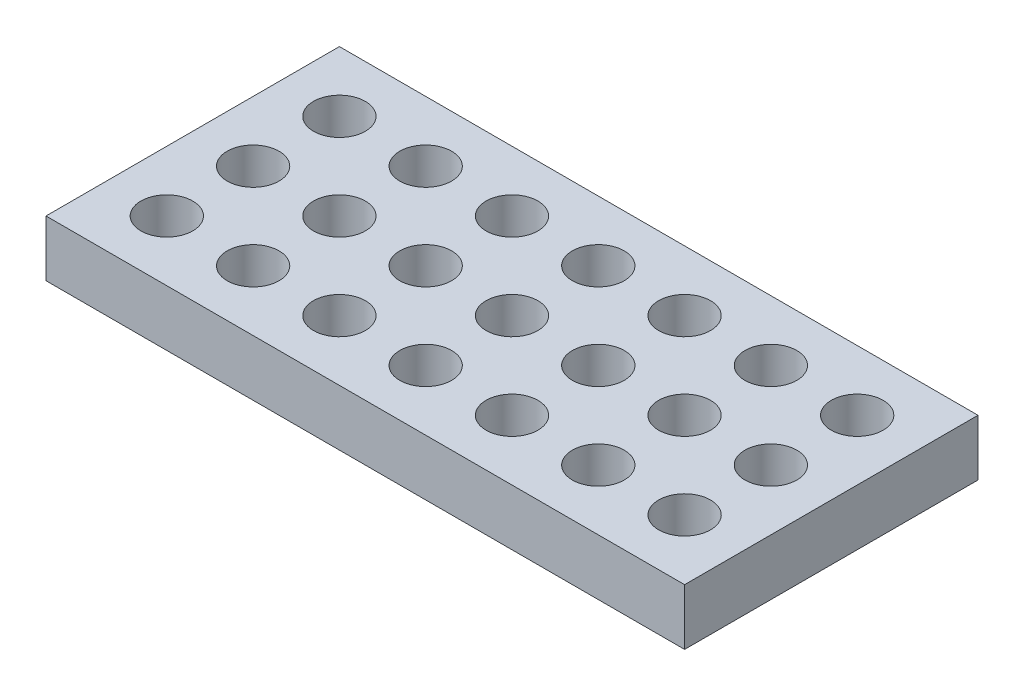
ISO-10303-21;
HEADER;
FILE_DESCRIPTION(('STEP AP214'),'2;1');
FILE_NAME('part.step','',(''),(''),'','','');
FILE_SCHEMA(('AUTOMOTIVE_DESIGN { 1 0 10303 214 1 1 1 1 }'));
ENDSEC;
DATA;
#1=APPLICATION_CONTEXT('core data for automotive mechanical design processes');
#2=APPLICATION_PROTOCOL_DEFINITION('international standard','automotive_design',2000,#1);
#3=PRODUCT_CONTEXT('',#1,'mechanical');
#4=PRODUCT('Part','Part','',(#3));
#5=PRODUCT_RELATED_PRODUCT_CATEGORY('part','',(#4));
#6=PRODUCT_DEFINITION_FORMATION('','',#4);
#7=PRODUCT_DEFINITION_CONTEXT('part definition',#1,'design');
#8=PRODUCT_DEFINITION('design','',#6,#7);
#9=PRODUCT_DEFINITION_SHAPE('','',#8);
#10=(LENGTH_UNIT() NAMED_UNIT(*) SI_UNIT(.MILLI.,.METRE.));
#11=(NAMED_UNIT(*) PLANE_ANGLE_UNIT() SI_UNIT($,.RADIAN.));
#12=(NAMED_UNIT(*) SI_UNIT($,.STERADIAN.) SOLID_ANGLE_UNIT());
#13=UNCERTAINTY_MEASURE_WITH_UNIT(LENGTH_MEASURE(1.E-05),#10,'distance_accuracy_value','');
#14=(GEOMETRIC_REPRESENTATION_CONTEXT(3) GLOBAL_UNCERTAINTY_ASSIGNED_CONTEXT((#13)) GLOBAL_UNIT_ASSIGNED_CONTEXT((#10,
#11,#12)) REPRESENTATION_CONTEXT('',''));
#15=CARTESIAN_POINT('',(0.,0.,0.));
#16=DIRECTION('',(0.,0.,1.));
#17=DIRECTION('',(1.,0.,0.));
#18=AXIS2_PLACEMENT_3D('',#15,#16,#17);
#19=CARTESIAN_POINT('',(0.,3.25,0.));
#20=DIRECTION('',(0.,1.,0.));
#21=DIRECTION('',(0.,0.,1.));
#22=AXIS2_PLACEMENT_3D('',#19,#20,#21);
#23=PLANE('',#22);
#24=CARTESIAN_POINT('',(-15.,3.25,0.));
#25=DIRECTION('',(0.,1.,0.));
#26=DIRECTION('',(0.,0.,1.));
#27=AXIS2_PLACEMENT_3D('',#24,#25,#26);
#28=CIRCLE('',#27,1.5025);
#29=CARTESIAN_POINT('',(-15.,3.25,1.5025));
#30=VERTEX_POINT('',#29);
#31=EDGE_CURVE('E224',#30,#30,#28,.T.);
#32=ORIENTED_EDGE('',*,*,#31,.F.);
#33=EDGE_LOOP('',(#32));
#34=FACE_BOUND('',#33,.T.);
#35=CARTESIAN_POINT('',(9.99999999999996,3.25,-5.));
#36=DIRECTION('',(0.,1.,0.));
#37=DIRECTION('',(0.,0.,1.));
#38=AXIS2_PLACEMENT_3D('',#35,#36,#37);
#39=CIRCLE('',#38,1.5025);
#40=CARTESIAN_POINT('',(9.99999999999996,3.25,-3.4975));
#41=VERTEX_POINT('',#40);
#42=EDGE_CURVE('E212',#41,#41,#39,.T.);
#43=ORIENTED_EDGE('',*,*,#42,.F.);
#44=EDGE_LOOP('',(#43));
#45=FACE_BOUND('',#44,.T.);
#46=CARTESIAN_POINT('',(0.,3.25,-5.));
#47=DIRECTION('',(0.,1.,0.));
#48=DIRECTION('',(0.,0.,1.));
#49=AXIS2_PLACEMENT_3D('',#46,#47,#48);
#50=CIRCLE('',#49,1.5025);
#51=CARTESIAN_POINT('',(0.,3.25,-3.4975));
#52=VERTEX_POINT('',#51);
#53=EDGE_CURVE('E200',#52,#52,#50,.T.);
#54=ORIENTED_EDGE('',*,*,#53,.F.);
#55=EDGE_LOOP('',(#54));
#56=FACE_BOUND('',#55,.T.);
#57=CARTESIAN_POINT('',(-10.,3.25,-5.));
#58=DIRECTION('',(0.,1.,0.));
#59=DIRECTION('',(0.,0.,1.));
#60=AXIS2_PLACEMENT_3D('',#57,#58,#59);
#61=CIRCLE('',#60,1.5025);
#62=CARTESIAN_POINT('',(-10.,3.25,-3.4975));
#63=VERTEX_POINT('',#62);
#64=EDGE_CURVE('E188',#63,#63,#61,.T.);
#65=ORIENTED_EDGE('',*,*,#64,.F.);
#66=EDGE_LOOP('',(#65));
#67=FACE_BOUND('',#66,.T.);
#68=CARTESIAN_POINT('',(9.99999999999998,3.25,0.));
#69=DIRECTION('',(0.,1.,0.));
#70=DIRECTION('',(0.,0.,1.));
#71=AXIS2_PLACEMENT_3D('',#68,#69,#70);
#72=CIRCLE('',#71,1.5025);
#73=CARTESIAN_POINT('',(9.99999999999998,3.25,1.5025));
#74=VERTEX_POINT('',#73);
#75=EDGE_CURVE('E176',#74,#74,#72,.T.);
#76=ORIENTED_EDGE('',*,*,#75,.F.);
#77=EDGE_LOOP('',(#76));
#78=FACE_BOUND('',#77,.T.);
#79=CARTESIAN_POINT('',(0.,3.25,0.));
#80=DIRECTION('',(0.,1.,0.));
#81=DIRECTION('',(0.,0.,1.));
#82=AXIS2_PLACEMENT_3D('',#79,#80,#81);
#83=CIRCLE('',#82,1.5025);
#84=CARTESIAN_POINT('',(0.,3.25,1.5025));
#85=VERTEX_POINT('',#84);
#86=EDGE_CURVE('E164',#85,#85,#83,.T.);
#87=ORIENTED_EDGE('',*,*,#86,.F.);
#88=EDGE_LOOP('',(#87));
#89=FACE_BOUND('',#88,.T.);
#90=CARTESIAN_POINT('',(-10.,3.25,0.));
#91=DIRECTION('',(0.,1.,0.));
#92=DIRECTION('',(0.,0.,1.));
#93=AXIS2_PLACEMENT_3D('',#90,#91,#92);
#94=CIRCLE('',#93,1.5025);
#95=CARTESIAN_POINT('',(-10.,3.25,1.5025));
#96=VERTEX_POINT('',#95);
#97=EDGE_CURVE('E152',#96,#96,#94,.T.);
#98=ORIENTED_EDGE('',*,*,#97,.F.);
#99=EDGE_LOOP('',(#98));
#100=FACE_BOUND('',#99,.T.);
#101=CARTESIAN_POINT('',(9.99999999999999,3.25,5.));
#102=DIRECTION('',(0.,1.,0.));
#103=DIRECTION('',(0.,0.,1.));
#104=AXIS2_PLACEMENT_3D('',#101,#102,#103);
#105=CIRCLE('',#104,1.5025);
#106=CARTESIAN_POINT('',(9.99999999999999,3.25,6.5025));
#107=VERTEX_POINT('',#106);
#108=EDGE_CURVE('E140',#107,#107,#105,.T.);
#109=ORIENTED_EDGE('',*,*,#108,.F.);
#110=EDGE_LOOP('',(#109));
#111=FACE_BOUND('',#110,.T.);
#112=CARTESIAN_POINT('',(0.,3.25,5.));
#113=DIRECTION('',(0.,1.,0.));
#114=DIRECTION('',(0.,0.,1.));
#115=AXIS2_PLACEMENT_3D('',#112,#113,#114);
#116=CIRCLE('',#115,1.5025);
#117=CARTESIAN_POINT('',(0.,3.25,6.5025));
#118=VERTEX_POINT('',#117);
#119=EDGE_CURVE('E128',#118,#118,#116,.T.);
#120=ORIENTED_EDGE('',*,*,#119,.F.);
#121=EDGE_LOOP('',(#120));
#122=FACE_BOUND('',#121,.T.);
#123=CARTESIAN_POINT('',(-10.,3.25,5.));
#124=DIRECTION('',(0.,1.,0.));
#125=DIRECTION('',(0.,0.,1.));
#126=AXIS2_PLACEMENT_3D('',#123,#124,#125);
#127=CIRCLE('',#126,1.5025);
#128=CARTESIAN_POINT('',(-10.,3.25,6.5025));
#129=VERTEX_POINT('',#128);
#130=EDGE_CURVE('E116',#129,#129,#127,.T.);
#131=ORIENTED_EDGE('',*,*,#130,.F.);
#132=EDGE_LOOP('',(#131));
#133=FACE_BOUND('',#132,.T.);
#134=DIRECTION('',(0.,0.,1.));
#135=VECTOR('',#134,1.);
#136=CARTESIAN_POINT('',(-18.5,3.25,-8.5));
#137=LINE('',#136,#135);
#138=CARTESIAN_POINT('',(-18.5,3.25,-8.5));
#139=VERTEX_POINT('',#138);
#140=CARTESIAN_POINT('',(-18.5,3.25,8.5));
#141=VERTEX_POINT('',#140);
#142=EDGE_CURVE('E86',#139,#141,#137,.T.);
#143=ORIENTED_EDGE('',*,*,#142,.T.);
#144=DIRECTION('',(1.,0.,0.));
#145=VECTOR('',#144,1.);
#146=CARTESIAN_POINT('',(-18.5,3.25,8.5));
#147=LINE('',#146,#145);
#148=CARTESIAN_POINT('',(18.5,3.25,8.5));
#149=VERTEX_POINT('',#148);
#150=EDGE_CURVE('E81',#141,#149,#147,.T.);
#151=ORIENTED_EDGE('',*,*,#150,.T.);
#152=DIRECTION('',(0.,0.,-1.));
#153=VECTOR('',#152,1.);
#154=CARTESIAN_POINT('',(18.5,3.25,-8.5));
#155=LINE('',#154,#153);
#156=CARTESIAN_POINT('',(18.5,3.25,-8.5));
#157=VERTEX_POINT('',#156);
#158=EDGE_CURVE('E84',#149,#157,#155,.T.);
#159=ORIENTED_EDGE('',*,*,#158,.T.);
#160=DIRECTION('',(-1.,0.,0.));
#161=VECTOR('',#160,1.);
#162=CARTESIAN_POINT('',(-18.5,3.25,-8.5));
#163=LINE('',#162,#161);
#164=EDGE_CURVE('E51',#157,#139,#163,.T.);
#165=ORIENTED_EDGE('',*,*,#164,.T.);
#166=EDGE_LOOP('',(#143,#151,#159,#165));
#167=FACE_BOUND('',#166,.T.);
#168=CARTESIAN_POINT('',(-15.,3.25,5.));
#169=DIRECTION('',(0.,1.,0.));
#170=DIRECTION('',(0.,0.,1.));
#171=AXIS2_PLACEMENT_3D('',#168,#169,#170);
#172=CIRCLE('',#171,1.5025);
#173=CARTESIAN_POINT('',(-15.,3.25,6.5025));
#174=VERTEX_POINT('',#173);
#175=EDGE_CURVE('E101',#174,#174,#172,.T.);
#176=ORIENTED_EDGE('',*,*,#175,.F.);
#177=EDGE_LOOP('',(#176));
#178=FACE_BOUND('',#177,.T.);
#179=CARTESIAN_POINT('',(-5.,3.25,5.));
#180=DIRECTION('',(0.,1.,0.));
#181=DIRECTION('',(0.,0.,1.));
#182=AXIS2_PLACEMENT_3D('',#179,#180,#181);
#183=CIRCLE('',#182,1.5025);
#184=CARTESIAN_POINT('',(-5.,3.25,6.5025));
#185=VERTEX_POINT('',#184);
#186=EDGE_CURVE('E122',#185,#185,#183,.T.);
#187=ORIENTED_EDGE('',*,*,#186,.F.);
#188=EDGE_LOOP('',(#187));
#189=FACE_BOUND('',#188,.T.);
#190=CARTESIAN_POINT('',(5.,3.25,5.));
#191=DIRECTION('',(0.,1.,0.));
#192=DIRECTION('',(0.,0.,1.));
#193=AXIS2_PLACEMENT_3D('',#190,#191,#192);
#194=CIRCLE('',#193,1.5025);
#195=CARTESIAN_POINT('',(5.,3.25,6.5025));
#196=VERTEX_POINT('',#195);
#197=EDGE_CURVE('E134',#196,#196,#194,.T.);
#198=ORIENTED_EDGE('',*,*,#197,.F.);
#199=EDGE_LOOP('',(#198));
#200=FACE_BOUND('',#199,.T.);
#201=CARTESIAN_POINT('',(15.,3.25,5.));
#202=DIRECTION('',(0.,1.,0.));
#203=DIRECTION('',(0.,0.,1.));
#204=AXIS2_PLACEMENT_3D('',#201,#202,#203);
#205=CIRCLE('',#204,1.5025);
#206=CARTESIAN_POINT('',(15.,3.25,6.5025));
#207=VERTEX_POINT('',#206);
#208=EDGE_CURVE('E146',#207,#207,#205,.T.);
#209=ORIENTED_EDGE('',*,*,#208,.F.);
#210=EDGE_LOOP('',(#209));
#211=FACE_BOUND('',#210,.T.);
#212=CARTESIAN_POINT('',(-5.00000000000002,3.25,0.));
#213=DIRECTION('',(0.,1.,0.));
#214=DIRECTION('',(0.,0.,1.));
#215=AXIS2_PLACEMENT_3D('',#212,#213,#214);
#216=CIRCLE('',#215,1.5025);
#217=CARTESIAN_POINT('',(-5.00000000000002,3.25,1.5025));
#218=VERTEX_POINT('',#217);
#219=EDGE_CURVE('E158',#218,#218,#216,.T.);
#220=ORIENTED_EDGE('',*,*,#219,.F.);
#221=EDGE_LOOP('',(#220));
#222=FACE_BOUND('',#221,.T.);
#223=CARTESIAN_POINT('',(4.99999999999998,3.25,0.));
#224=DIRECTION('',(0.,1.,0.));
#225=DIRECTION('',(0.,0.,1.));
#226=AXIS2_PLACEMENT_3D('',#223,#224,#225);
#227=CIRCLE('',#226,1.5025);
#228=CARTESIAN_POINT('',(4.99999999999998,3.25,1.5025));
#229=VERTEX_POINT('',#228);
#230=EDGE_CURVE('E170',#229,#229,#227,.T.);
#231=ORIENTED_EDGE('',*,*,#230,.F.);
#232=EDGE_LOOP('',(#231));
#233=FACE_BOUND('',#232,.T.);
#234=CARTESIAN_POINT('',(15.,3.25,0.));
#235=DIRECTION('',(0.,1.,0.));
#236=DIRECTION('',(0.,0.,1.));
#237=AXIS2_PLACEMENT_3D('',#234,#235,#236);
#238=CIRCLE('',#237,1.5025);
#239=CARTESIAN_POINT('',(15.,3.25,1.5025));
#240=VERTEX_POINT('',#239);
#241=EDGE_CURVE('E182',#240,#240,#238,.T.);
#242=ORIENTED_EDGE('',*,*,#241,.F.);
#243=EDGE_LOOP('',(#242));
#244=FACE_BOUND('',#243,.T.);
#245=CARTESIAN_POINT('',(-5.00000000000004,3.25,-5.));
#246=DIRECTION('',(0.,1.,0.));
#247=DIRECTION('',(0.,0.,1.));
#248=AXIS2_PLACEMENT_3D('',#245,#246,#247);
#249=CIRCLE('',#248,1.5025);
#250=CARTESIAN_POINT('',(-5.00000000000004,3.25,-3.4975));
#251=VERTEX_POINT('',#250);
#252=EDGE_CURVE('E194',#251,#251,#249,.T.);
#253=ORIENTED_EDGE('',*,*,#252,.F.);
#254=EDGE_LOOP('',(#253));
#255=FACE_BOUND('',#254,.T.);
#256=CARTESIAN_POINT('',(4.99999999999996,3.25,-5.));
#257=DIRECTION('',(0.,1.,0.));
#258=DIRECTION('',(0.,0.,1.));
#259=AXIS2_PLACEMENT_3D('',#256,#257,#258);
#260=CIRCLE('',#259,1.5025);
#261=CARTESIAN_POINT('',(4.99999999999996,3.25,-3.4975));
#262=VERTEX_POINT('',#261);
#263=EDGE_CURVE('E206',#262,#262,#260,.T.);
#264=ORIENTED_EDGE('',*,*,#263,.F.);
#265=EDGE_LOOP('',(#264));
#266=FACE_BOUND('',#265,.T.);
#267=CARTESIAN_POINT('',(15.,3.25,-5.));
#268=DIRECTION('',(0.,1.,0.));
#269=DIRECTION('',(0.,0.,1.));
#270=AXIS2_PLACEMENT_3D('',#267,#268,#269);
#271=CIRCLE('',#270,1.5025);
#272=CARTESIAN_POINT('',(15.,3.25,-3.4975));
#273=VERTEX_POINT('',#272);
#274=EDGE_CURVE('E218',#273,#273,#271,.T.);
#275=ORIENTED_EDGE('',*,*,#274,.F.);
#276=EDGE_LOOP('',(#275));
#277=FACE_BOUND('',#276,.T.);
#278=CARTESIAN_POINT('',(-15.,3.25,-5.));
#279=DIRECTION('',(0.,1.,0.));
#280=DIRECTION('',(0.,0.,1.));
#281=AXIS2_PLACEMENT_3D('',#278,#279,#280);
#282=CIRCLE('',#281,1.5025);
#283=CARTESIAN_POINT('',(-15.,3.25,-3.4975));
#284=VERTEX_POINT('',#283);
#285=EDGE_CURVE('E230',#284,#284,#282,.T.);
#286=ORIENTED_EDGE('',*,*,#285,.F.);
#287=EDGE_LOOP('',(#286));
#288=FACE_BOUND('',#287,.T.);
#289=ADVANCED_FACE('F34',(#34,#45,#56,#67,#78,#89,#100,#111,#122,#133,#167,#178,#189,#200,#211,
#222,#233,#244,#255,#266,#277,#288),#23,.T.);
#290=CARTESIAN_POINT('',(0.,0.,0.));
#291=DIRECTION('',(0.,1.,0.));
#292=DIRECTION('',(0.,0.,1.));
#293=AXIS2_PLACEMENT_3D('',#290,#291,#292);
#294=PLANE('',#293);
#295=DIRECTION('',(0.,0.,1.));
#296=VECTOR('',#295,1.);
#297=CARTESIAN_POINT('',(-18.5,0.,-8.5));
#298=LINE('',#297,#296);
#299=CARTESIAN_POINT('',(-18.5,0.,-8.5));
#300=VERTEX_POINT('',#299);
#301=CARTESIAN_POINT('',(-18.5,0.,8.5));
#302=VERTEX_POINT('',#301);
#303=EDGE_CURVE('E98',#300,#302,#298,.T.);
#304=ORIENTED_EDGE('',*,*,#303,.F.);
#305=DIRECTION('',(-1.,0.,0.));
#306=VECTOR('',#305,1.);
#307=CARTESIAN_POINT('',(-18.5,0.,-8.5));
#308=LINE('',#307,#306);
#309=CARTESIAN_POINT('',(18.5,0.,-8.5));
#310=VERTEX_POINT('',#309);
#311=EDGE_CURVE('E74',#310,#300,#308,.T.);
#312=ORIENTED_EDGE('',*,*,#311,.F.);
#313=DIRECTION('',(0.,0.,-1.));
#314=VECTOR('',#313,1.);
#315=CARTESIAN_POINT('',(18.5,0.,-8.5));
#316=LINE('',#315,#314);
#317=CARTESIAN_POINT('',(18.5,0.,8.5));
#318=VERTEX_POINT('',#317);
#319=EDGE_CURVE('E68',#318,#310,#316,.T.);
#320=ORIENTED_EDGE('',*,*,#319,.F.);
#321=DIRECTION('',(1.,0.,0.));
#322=VECTOR('',#321,1.);
#323=CARTESIAN_POINT('',(-18.5,0.,8.5));
#324=LINE('',#323,#322);
#325=EDGE_CURVE('E90',#302,#318,#324,.T.);
#326=ORIENTED_EDGE('',*,*,#325,.F.);
#327=EDGE_LOOP('',(#304,#312,#320,#326));
#328=FACE_BOUND('',#327,.T.);
#329=CARTESIAN_POINT('',(-15.,0.,5.));
#330=DIRECTION('',(0.,1.,0.));
#331=DIRECTION('',(0.,0.,1.));
#332=AXIS2_PLACEMENT_3D('',#329,#330,#331);
#333=CIRCLE('',#332,1.5025);
#334=CARTESIAN_POINT('',(-15.,0.,6.5025));
#335=VERTEX_POINT('',#334);
#336=EDGE_CURVE('E113',#335,#335,#333,.T.);
#337=ORIENTED_EDGE('',*,*,#336,.T.);
#338=EDGE_LOOP('',(#337));
#339=FACE_BOUND('',#338,.T.);
#340=CARTESIAN_POINT('',(-10.,0.,5.));
#341=DIRECTION('',(0.,1.,0.));
#342=DIRECTION('',(0.,0.,1.));
#343=AXIS2_PLACEMENT_3D('',#340,#341,#342);
#344=CIRCLE('',#343,1.5025);
#345=CARTESIAN_POINT('',(-10.,0.,6.5025));
#346=VERTEX_POINT('',#345);
#347=EDGE_CURVE('E119',#346,#346,#344,.T.);
#348=ORIENTED_EDGE('',*,*,#347,.T.);
#349=EDGE_LOOP('',(#348));
#350=FACE_BOUND('',#349,.T.);
#351=CARTESIAN_POINT('',(-5.,0.,5.));
#352=DIRECTION('',(0.,1.,0.));
#353=DIRECTION('',(0.,0.,1.));
#354=AXIS2_PLACEMENT_3D('',#351,#352,#353);
#355=CIRCLE('',#354,1.5025);
#356=CARTESIAN_POINT('',(-5.,0.,6.5025));
#357=VERTEX_POINT('',#356);
#358=EDGE_CURVE('E125',#357,#357,#355,.T.);
#359=ORIENTED_EDGE('',*,*,#358,.T.);
#360=EDGE_LOOP('',(#359));
#361=FACE_BOUND('',#360,.T.);
#362=CARTESIAN_POINT('',(0.,0.,5.));
#363=DIRECTION('',(0.,1.,0.));
#364=DIRECTION('',(0.,0.,1.));
#365=AXIS2_PLACEMENT_3D('',#362,#363,#364);
#366=CIRCLE('',#365,1.5025);
#367=CARTESIAN_POINT('',(0.,0.,6.5025));
#368=VERTEX_POINT('',#367);
#369=EDGE_CURVE('E131',#368,#368,#366,.T.);
#370=ORIENTED_EDGE('',*,*,#369,.T.);
#371=EDGE_LOOP('',(#370));
#372=FACE_BOUND('',#371,.T.);
#373=CARTESIAN_POINT('',(5.,0.,5.));
#374=DIRECTION('',(0.,1.,0.));
#375=DIRECTION('',(0.,0.,1.));
#376=AXIS2_PLACEMENT_3D('',#373,#374,#375);
#377=CIRCLE('',#376,1.5025);
#378=CARTESIAN_POINT('',(5.,0.,6.5025));
#379=VERTEX_POINT('',#378);
#380=EDGE_CURVE('E137',#379,#379,#377,.T.);
#381=ORIENTED_EDGE('',*,*,#380,.T.);
#382=EDGE_LOOP('',(#381));
#383=FACE_BOUND('',#382,.T.);
#384=CARTESIAN_POINT('',(9.99999999999999,0.,5.));
#385=DIRECTION('',(0.,1.,0.));
#386=DIRECTION('',(0.,0.,1.));
#387=AXIS2_PLACEMENT_3D('',#384,#385,#386);
#388=CIRCLE('',#387,1.5025);
#389=CARTESIAN_POINT('',(9.99999999999999,0.,6.5025));
#390=VERTEX_POINT('',#389);
#391=EDGE_CURVE('E143',#390,#390,#388,.T.);
#392=ORIENTED_EDGE('',*,*,#391,.T.);
#393=EDGE_LOOP('',(#392));
#394=FACE_BOUND('',#393,.T.);
#395=CARTESIAN_POINT('',(15.,0.,5.));
#396=DIRECTION('',(0.,1.,0.));
#397=DIRECTION('',(0.,0.,1.));
#398=AXIS2_PLACEMENT_3D('',#395,#396,#397);
#399=CIRCLE('',#398,1.5025);
#400=CARTESIAN_POINT('',(15.,0.,6.5025));
#401=VERTEX_POINT('',#400);
#402=EDGE_CURVE('E149',#401,#401,#399,.T.);
#403=ORIENTED_EDGE('',*,*,#402,.T.);
#404=EDGE_LOOP('',(#403));
#405=FACE_BOUND('',#404,.T.);
#406=CARTESIAN_POINT('',(-10.,0.,0.));
#407=DIRECTION('',(0.,1.,0.));
#408=DIRECTION('',(0.,0.,1.));
#409=AXIS2_PLACEMENT_3D('',#406,#407,#408);
#410=CIRCLE('',#409,1.5025);
#411=CARTESIAN_POINT('',(-10.,0.,1.5025));
#412=VERTEX_POINT('',#411);
#413=EDGE_CURVE('E155',#412,#412,#410,.T.);
#414=ORIENTED_EDGE('',*,*,#413,.T.);
#415=EDGE_LOOP('',(#414));
#416=FACE_BOUND('',#415,.T.);
#417=CARTESIAN_POINT('',(-5.00000000000002,0.,0.));
#418=DIRECTION('',(0.,1.,0.));
#419=DIRECTION('',(0.,0.,1.));
#420=AXIS2_PLACEMENT_3D('',#417,#418,#419);
#421=CIRCLE('',#420,1.5025);
#422=CARTESIAN_POINT('',(-5.00000000000002,0.,1.5025));
#423=VERTEX_POINT('',#422);
#424=EDGE_CURVE('E161',#423,#423,#421,.T.);
#425=ORIENTED_EDGE('',*,*,#424,.T.);
#426=EDGE_LOOP('',(#425));
#427=FACE_BOUND('',#426,.T.);
#428=CARTESIAN_POINT('',(0.,0.,0.));
#429=DIRECTION('',(0.,1.,0.));
#430=DIRECTION('',(0.,0.,1.));
#431=AXIS2_PLACEMENT_3D('',#428,#429,#430);
#432=CIRCLE('',#431,1.5025);
#433=CARTESIAN_POINT('',(0.,0.,1.5025));
#434=VERTEX_POINT('',#433);
#435=EDGE_CURVE('E167',#434,#434,#432,.T.);
#436=ORIENTED_EDGE('',*,*,#435,.T.);
#437=EDGE_LOOP('',(#436));
#438=FACE_BOUND('',#437,.T.);
#439=CARTESIAN_POINT('',(4.99999999999998,0.,0.));
#440=DIRECTION('',(0.,1.,0.));
#441=DIRECTION('',(0.,0.,1.));
#442=AXIS2_PLACEMENT_3D('',#439,#440,#441);
#443=CIRCLE('',#442,1.5025);
#444=CARTESIAN_POINT('',(4.99999999999998,0.,1.5025));
#445=VERTEX_POINT('',#444);
#446=EDGE_CURVE('E173',#445,#445,#443,.T.);
#447=ORIENTED_EDGE('',*,*,#446,.T.);
#448=EDGE_LOOP('',(#447));
#449=FACE_BOUND('',#448,.T.);
#450=CARTESIAN_POINT('',(9.99999999999998,0.,0.));
#451=DIRECTION('',(0.,1.,0.));
#452=DIRECTION('',(0.,0.,1.));
#453=AXIS2_PLACEMENT_3D('',#450,#451,#452);
#454=CIRCLE('',#453,1.5025);
#455=CARTESIAN_POINT('',(9.99999999999998,0.,1.5025));
#456=VERTEX_POINT('',#455);
#457=EDGE_CURVE('E179',#456,#456,#454,.T.);
#458=ORIENTED_EDGE('',*,*,#457,.T.);
#459=EDGE_LOOP('',(#458));
#460=FACE_BOUND('',#459,.T.);
#461=CARTESIAN_POINT('',(15.,0.,0.));
#462=DIRECTION('',(0.,1.,0.));
#463=DIRECTION('',(0.,0.,1.));
#464=AXIS2_PLACEMENT_3D('',#461,#462,#463);
#465=CIRCLE('',#464,1.5025);
#466=CARTESIAN_POINT('',(15.,0.,1.5025));
#467=VERTEX_POINT('',#466);
#468=EDGE_CURVE('E185',#467,#467,#465,.T.);
#469=ORIENTED_EDGE('',*,*,#468,.T.);
#470=EDGE_LOOP('',(#469));
#471=FACE_BOUND('',#470,.T.);
#472=CARTESIAN_POINT('',(-10.,0.,-5.));
#473=DIRECTION('',(0.,1.,0.));
#474=DIRECTION('',(0.,0.,1.));
#475=AXIS2_PLACEMENT_3D('',#472,#473,#474);
#476=CIRCLE('',#475,1.5025);
#477=CARTESIAN_POINT('',(-10.,0.,-3.4975));
#478=VERTEX_POINT('',#477);
#479=EDGE_CURVE('E191',#478,#478,#476,.T.);
#480=ORIENTED_EDGE('',*,*,#479,.T.);
#481=EDGE_LOOP('',(#480));
#482=FACE_BOUND('',#481,.T.);
#483=CARTESIAN_POINT('',(-5.00000000000004,0.,-5.));
#484=DIRECTION('',(0.,1.,0.));
#485=DIRECTION('',(0.,0.,1.));
#486=AXIS2_PLACEMENT_3D('',#483,#484,#485);
#487=CIRCLE('',#486,1.5025);
#488=CARTESIAN_POINT('',(-5.00000000000004,0.,-3.4975));
#489=VERTEX_POINT('',#488);
#490=EDGE_CURVE('E197',#489,#489,#487,.T.);
#491=ORIENTED_EDGE('',*,*,#490,.T.);
#492=EDGE_LOOP('',(#491));
#493=FACE_BOUND('',#492,.T.);
#494=CARTESIAN_POINT('',(0.,0.,-5.));
#495=DIRECTION('',(0.,1.,0.));
#496=DIRECTION('',(0.,0.,1.));
#497=AXIS2_PLACEMENT_3D('',#494,#495,#496);
#498=CIRCLE('',#497,1.5025);
#499=CARTESIAN_POINT('',(0.,0.,-3.4975));
#500=VERTEX_POINT('',#499);
#501=EDGE_CURVE('E203',#500,#500,#498,.T.);
#502=ORIENTED_EDGE('',*,*,#501,.T.);
#503=EDGE_LOOP('',(#502));
#504=FACE_BOUND('',#503,.T.);
#505=CARTESIAN_POINT('',(4.99999999999996,0.,-5.));
#506=DIRECTION('',(0.,1.,0.));
#507=DIRECTION('',(0.,0.,1.));
#508=AXIS2_PLACEMENT_3D('',#505,#506,#507);
#509=CIRCLE('',#508,1.5025);
#510=CARTESIAN_POINT('',(4.99999999999996,0.,-3.4975));
#511=VERTEX_POINT('',#510);
#512=EDGE_CURVE('E209',#511,#511,#509,.T.);
#513=ORIENTED_EDGE('',*,*,#512,.T.);
#514=EDGE_LOOP('',(#513));
#515=FACE_BOUND('',#514,.T.);
#516=CARTESIAN_POINT('',(9.99999999999996,0.,-5.));
#517=DIRECTION('',(0.,1.,0.));
#518=DIRECTION('',(0.,0.,1.));
#519=AXIS2_PLACEMENT_3D('',#516,#517,#518);
#520=CIRCLE('',#519,1.5025);
#521=CARTESIAN_POINT('',(9.99999999999996,0.,-3.4975));
#522=VERTEX_POINT('',#521);
#523=EDGE_CURVE('E215',#522,#522,#520,.T.);
#524=ORIENTED_EDGE('',*,*,#523,.T.);
#525=EDGE_LOOP('',(#524));
#526=FACE_BOUND('',#525,.T.);
#527=CARTESIAN_POINT('',(15.,0.,-5.));
#528=DIRECTION('',(0.,1.,0.));
#529=DIRECTION('',(0.,0.,1.));
#530=AXIS2_PLACEMENT_3D('',#527,#528,#529);
#531=CIRCLE('',#530,1.5025);
#532=CARTESIAN_POINT('',(15.,0.,-3.4975));
#533=VERTEX_POINT('',#532);
#534=EDGE_CURVE('E221',#533,#533,#531,.T.);
#535=ORIENTED_EDGE('',*,*,#534,.T.);
#536=EDGE_LOOP('',(#535));
#537=FACE_BOUND('',#536,.T.);
#538=CARTESIAN_POINT('',(-15.,0.,0.));
#539=DIRECTION('',(0.,1.,0.));
#540=DIRECTION('',(0.,0.,1.));
#541=AXIS2_PLACEMENT_3D('',#538,#539,#540);
#542=CIRCLE('',#541,1.5025);
#543=CARTESIAN_POINT('',(-15.,0.,1.5025));
#544=VERTEX_POINT('',#543);
#545=EDGE_CURVE('E227',#544,#544,#542,.T.);
#546=ORIENTED_EDGE('',*,*,#545,.T.);
#547=EDGE_LOOP('',(#546));
#548=FACE_BOUND('',#547,.T.);
#549=CARTESIAN_POINT('',(-15.,0.,-5.));
#550=DIRECTION('',(0.,1.,0.));
#551=DIRECTION('',(0.,0.,1.));
#552=AXIS2_PLACEMENT_3D('',#549,#550,#551);
#553=CIRCLE('',#552,1.5025);
#554=CARTESIAN_POINT('',(-15.,0.,-3.4975));
#555=VERTEX_POINT('',#554);
#556=EDGE_CURVE('E233',#555,#555,#553,.T.);
#557=ORIENTED_EDGE('',*,*,#556,.T.);
#558=EDGE_LOOP('',(#557));
#559=FACE_BOUND('',#558,.T.);
#560=ADVANCED_FACE('F109',(#328,#339,#350,#361,#372,#383,#394,#405,#416,#427,#438,#449,#460,
#471,#482,#493,#504,#515,#526,#537,#548,#559),#294,.F.);
#561=CARTESIAN_POINT('',(-18.5,3.25,-8.5));
#562=DIRECTION('',(1.,0.,0.));
#563=DIRECTION('',(0.,0.,-1.));
#564=AXIS2_PLACEMENT_3D('',#561,#562,#563);
#565=PLANE('',#564);
#566=ORIENTED_EDGE('',*,*,#303,.T.);
#567=DIRECTION('',(0.,-1.,0.));
#568=VECTOR('',#567,1.);
#569=CARTESIAN_POINT('',(-18.5,3.25,8.5));
#570=LINE('',#569,#568);
#571=EDGE_CURVE('E11',#141,#302,#570,.T.);
#572=ORIENTED_EDGE('',*,*,#571,.F.);
#573=ORIENTED_EDGE('',*,*,#142,.F.);
#574=DIRECTION('',(0.,-1.,0.));
#575=VECTOR('',#574,1.);
#576=CARTESIAN_POINT('',(-18.5,3.25,-8.5));
#577=LINE('',#576,#575);
#578=EDGE_CURVE('E94',#139,#300,#577,.T.);
#579=ORIENTED_EDGE('',*,*,#578,.T.);
#580=EDGE_LOOP('',(#566,#572,#573,#579));
#581=FACE_BOUND('',#580,.T.);
#582=ADVANCED_FACE('F36',(#581),#565,.F.);
#583=CARTESIAN_POINT('',(-18.5,3.25,8.5));
#584=DIRECTION('',(0.,0.,-1.));
#585=DIRECTION('',(-1.,0.,0.));
#586=AXIS2_PLACEMENT_3D('',#583,#584,#585);
#587=PLANE('',#586);
#588=ORIENTED_EDGE('',*,*,#325,.T.);
#589=DIRECTION('',(0.,-1.,0.));
#590=VECTOR('',#589,1.);
#591=CARTESIAN_POINT('',(18.5,3.25,8.5));
#592=LINE('',#591,#590);
#593=EDGE_CURVE('E43',#149,#318,#592,.T.);
#594=ORIENTED_EDGE('',*,*,#593,.F.);
#595=ORIENTED_EDGE('',*,*,#150,.F.);
#596=ORIENTED_EDGE('',*,*,#571,.T.);
#597=EDGE_LOOP('',(#588,#594,#595,#596));
#598=FACE_BOUND('',#597,.T.);
#599=ADVANCED_FACE('F89',(#598),#587,.F.);
#600=CARTESIAN_POINT('',(18.5,3.25,-8.5));
#601=DIRECTION('',(-1.,0.,0.));
#602=DIRECTION('',(0.,0.,1.));
#603=AXIS2_PLACEMENT_3D('',#600,#601,#602);
#604=PLANE('',#603);
#605=ORIENTED_EDGE('',*,*,#319,.T.);
#606=DIRECTION('',(0.,-1.,0.));
#607=VECTOR('',#606,1.);
#608=CARTESIAN_POINT('',(18.5,3.25,-8.5));
#609=LINE('',#608,#607);
#610=EDGE_CURVE('E91',#157,#310,#609,.T.);
#611=ORIENTED_EDGE('',*,*,#610,.F.);
#612=ORIENTED_EDGE('',*,*,#158,.F.);
#613=ORIENTED_EDGE('',*,*,#593,.T.);
#614=EDGE_LOOP('',(#605,#611,#612,#613));
#615=FACE_BOUND('',#614,.T.);
#616=ADVANCED_FACE('F92',(#615),#604,.F.);
#617=CARTESIAN_POINT('',(-18.5,3.25,-8.5));
#618=DIRECTION('',(0.,0.,1.));
#619=DIRECTION('',(1.,0.,0.));
#620=AXIS2_PLACEMENT_3D('',#617,#618,#619);
#621=PLANE('',#620);
#622=ORIENTED_EDGE('',*,*,#311,.T.);
#623=ORIENTED_EDGE('',*,*,#578,.F.);
#624=ORIENTED_EDGE('',*,*,#164,.F.);
#625=ORIENTED_EDGE('',*,*,#610,.T.);
#626=EDGE_LOOP('',(#622,#623,#624,#625));
#627=FACE_BOUND('',#626,.T.);
#628=ADVANCED_FACE('F106',(#627),#621,.F.);
#629=CARTESIAN_POINT('',(-15.,3.25,5.));
#630=DIRECTION('',(0.,-1.,0.));
#631=DIRECTION('',(0.,0.,-1.));
#632=AXIS2_PLACEMENT_3D('',#629,#630,#631);
#633=CYLINDRICAL_SURFACE('',#632,1.5025);
#634=ORIENTED_EDGE('',*,*,#175,.T.);
#635=EDGE_LOOP('',(#634));
#636=FACE_BOUND('',#635,.T.);
#637=ORIENTED_EDGE('',*,*,#336,.F.);
#638=EDGE_LOOP('',(#637));
#639=FACE_BOUND('',#638,.T.);
#640=ADVANCED_FACE('F252',(#636,#639),#633,.F.);
#641=CARTESIAN_POINT('',(-10.,3.25,5.));
#642=DIRECTION('',(0.,-1.,0.));
#643=DIRECTION('',(0.,0.,-1.));
#644=AXIS2_PLACEMENT_3D('',#641,#642,#643);
#645=CYLINDRICAL_SURFACE('',#644,1.5025);
#646=ORIENTED_EDGE('',*,*,#130,.T.);
#647=EDGE_LOOP('',(#646));
#648=FACE_BOUND('',#647,.T.);
#649=ORIENTED_EDGE('',*,*,#347,.F.);
#650=EDGE_LOOP('',(#649));
#651=FACE_BOUND('',#650,.T.);
#652=ADVANCED_FACE('F298',(#648,#651),#645,.F.);
#653=CARTESIAN_POINT('',(-5.,3.25,5.));
#654=DIRECTION('',(0.,-1.,0.));
#655=DIRECTION('',(0.,0.,-1.));
#656=AXIS2_PLACEMENT_3D('',#653,#654,#655);
#657=CYLINDRICAL_SURFACE('',#656,1.5025);
#658=ORIENTED_EDGE('',*,*,#186,.T.);
#659=EDGE_LOOP('',(#658));
#660=FACE_BOUND('',#659,.T.);
#661=ORIENTED_EDGE('',*,*,#358,.F.);
#662=EDGE_LOOP('',(#661));
#663=FACE_BOUND('',#662,.T.);
#664=ADVANCED_FACE('F306',(#660,#663),#657,.F.);
#665=CARTESIAN_POINT('',(0.,3.25,5.));
#666=DIRECTION('',(0.,-1.,0.));
#667=DIRECTION('',(0.,0.,-1.));
#668=AXIS2_PLACEMENT_3D('',#665,#666,#667);
#669=CYLINDRICAL_SURFACE('',#668,1.5025);
#670=ORIENTED_EDGE('',*,*,#119,.T.);
#671=EDGE_LOOP('',(#670));
#672=FACE_BOUND('',#671,.T.);
#673=ORIENTED_EDGE('',*,*,#369,.F.);
#674=EDGE_LOOP('',(#673));
#675=FACE_BOUND('',#674,.T.);
#676=ADVANCED_FACE('F314',(#672,#675),#669,.F.);
#677=CARTESIAN_POINT('',(5.,3.25,5.));
#678=DIRECTION('',(0.,-1.,0.));
#679=DIRECTION('',(0.,0.,-1.));
#680=AXIS2_PLACEMENT_3D('',#677,#678,#679);
#681=CYLINDRICAL_SURFACE('',#680,1.5025);
#682=ORIENTED_EDGE('',*,*,#197,.T.);
#683=EDGE_LOOP('',(#682));
#684=FACE_BOUND('',#683,.T.);
#685=ORIENTED_EDGE('',*,*,#380,.F.);
#686=EDGE_LOOP('',(#685));
#687=FACE_BOUND('',#686,.T.);
#688=ADVANCED_FACE('F323',(#684,#687),#681,.F.);
#689=CARTESIAN_POINT('',(9.99999999999999,3.25,5.));
#690=DIRECTION('',(0.,-1.,0.));
#691=DIRECTION('',(0.,0.,-1.));
#692=AXIS2_PLACEMENT_3D('',#689,#690,#691);
#693=CYLINDRICAL_SURFACE('',#692,1.5025);
#694=ORIENTED_EDGE('',*,*,#108,.T.);
#695=EDGE_LOOP('',(#694));
#696=FACE_BOUND('',#695,.T.);
#697=ORIENTED_EDGE('',*,*,#391,.F.);
#698=EDGE_LOOP('',(#697));
#699=FACE_BOUND('',#698,.T.);
#700=ADVANCED_FACE('F332',(#696,#699),#693,.F.);
#701=CARTESIAN_POINT('',(15.,3.25,5.));
#702=DIRECTION('',(0.,-1.,0.));
#703=DIRECTION('',(0.,0.,-1.));
#704=AXIS2_PLACEMENT_3D('',#701,#702,#703);
#705=CYLINDRICAL_SURFACE('',#704,1.5025);
#706=ORIENTED_EDGE('',*,*,#208,.T.);
#707=EDGE_LOOP('',(#706));
#708=FACE_BOUND('',#707,.T.);
#709=ORIENTED_EDGE('',*,*,#402,.F.);
#710=EDGE_LOOP('',(#709));
#711=FACE_BOUND('',#710,.T.);
#712=ADVANCED_FACE('F341',(#708,#711),#705,.F.);
#713=CARTESIAN_POINT('',(-10.,3.25,0.));
#714=DIRECTION('',(0.,-1.,0.));
#715=DIRECTION('',(0.,0.,-1.));
#716=AXIS2_PLACEMENT_3D('',#713,#714,#715);
#717=CYLINDRICAL_SURFACE('',#716,1.5025);
#718=ORIENTED_EDGE('',*,*,#97,.T.);
#719=EDGE_LOOP('',(#718));
#720=FACE_BOUND('',#719,.T.);
#721=ORIENTED_EDGE('',*,*,#413,.F.);
#722=EDGE_LOOP('',(#721));
#723=FACE_BOUND('',#722,.T.);
#724=ADVANCED_FACE('F350',(#720,#723),#717,.F.);
#725=CARTESIAN_POINT('',(-5.00000000000002,3.25,0.));
#726=DIRECTION('',(0.,-1.,0.));
#727=DIRECTION('',(0.,0.,-1.));
#728=AXIS2_PLACEMENT_3D('',#725,#726,#727);
#729=CYLINDRICAL_SURFACE('',#728,1.5025);
#730=ORIENTED_EDGE('',*,*,#219,.T.);
#731=EDGE_LOOP('',(#730));
#732=FACE_BOUND('',#731,.T.);
#733=ORIENTED_EDGE('',*,*,#424,.F.);
#734=EDGE_LOOP('',(#733));
#735=FACE_BOUND('',#734,.T.);
#736=ADVANCED_FACE('F359',(#732,#735),#729,.F.);
#737=CARTESIAN_POINT('',(0.,3.25,0.));
#738=DIRECTION('',(0.,-1.,0.));
#739=DIRECTION('',(0.,0.,-1.));
#740=AXIS2_PLACEMENT_3D('',#737,#738,#739);
#741=CYLINDRICAL_SURFACE('',#740,1.5025);
#742=ORIENTED_EDGE('',*,*,#86,.T.);
#743=EDGE_LOOP('',(#742));
#744=FACE_BOUND('',#743,.T.);
#745=ORIENTED_EDGE('',*,*,#435,.F.);
#746=EDGE_LOOP('',(#745));
#747=FACE_BOUND('',#746,.T.);
#748=ADVANCED_FACE('F368',(#744,#747),#741,.F.);
#749=CARTESIAN_POINT('',(4.99999999999998,3.25,0.));
#750=DIRECTION('',(0.,-1.,0.));
#751=DIRECTION('',(0.,0.,-1.));
#752=AXIS2_PLACEMENT_3D('',#749,#750,#751);
#753=CYLINDRICAL_SURFACE('',#752,1.5025);
#754=ORIENTED_EDGE('',*,*,#230,.T.);
#755=EDGE_LOOP('',(#754));
#756=FACE_BOUND('',#755,.T.);
#757=ORIENTED_EDGE('',*,*,#446,.F.);
#758=EDGE_LOOP('',(#757));
#759=FACE_BOUND('',#758,.T.);
#760=ADVANCED_FACE('F377',(#756,#759),#753,.F.);
#761=CARTESIAN_POINT('',(9.99999999999998,3.25,0.));
#762=DIRECTION('',(0.,-1.,0.));
#763=DIRECTION('',(0.,0.,-1.));
#764=AXIS2_PLACEMENT_3D('',#761,#762,#763);
#765=CYLINDRICAL_SURFACE('',#764,1.5025);
#766=ORIENTED_EDGE('',*,*,#75,.T.);
#767=EDGE_LOOP('',(#766));
#768=FACE_BOUND('',#767,.T.);
#769=ORIENTED_EDGE('',*,*,#457,.F.);
#770=EDGE_LOOP('',(#769));
#771=FACE_BOUND('',#770,.T.);
#772=ADVANCED_FACE('F386',(#768,#771),#765,.F.);
#773=CARTESIAN_POINT('',(15.,3.25,0.));
#774=DIRECTION('',(0.,-1.,0.));
#775=DIRECTION('',(0.,0.,-1.));
#776=AXIS2_PLACEMENT_3D('',#773,#774,#775);
#777=CYLINDRICAL_SURFACE('',#776,1.5025);
#778=ORIENTED_EDGE('',*,*,#241,.T.);
#779=EDGE_LOOP('',(#778));
#780=FACE_BOUND('',#779,.T.);
#781=ORIENTED_EDGE('',*,*,#468,.F.);
#782=EDGE_LOOP('',(#781));
#783=FACE_BOUND('',#782,.T.);
#784=ADVANCED_FACE('F395',(#780,#783),#777,.F.);
#785=CARTESIAN_POINT('',(-10.,3.25,-5.));
#786=DIRECTION('',(0.,-1.,0.));
#787=DIRECTION('',(0.,0.,-1.));
#788=AXIS2_PLACEMENT_3D('',#785,#786,#787);
#789=CYLINDRICAL_SURFACE('',#788,1.5025);
#790=ORIENTED_EDGE('',*,*,#64,.T.);
#791=EDGE_LOOP('',(#790));
#792=FACE_BOUND('',#791,.T.);
#793=ORIENTED_EDGE('',*,*,#479,.F.);
#794=EDGE_LOOP('',(#793));
#795=FACE_BOUND('',#794,.T.);
#796=ADVANCED_FACE('F404',(#792,#795),#789,.F.);
#797=CARTESIAN_POINT('',(-5.00000000000004,3.25,-5.));
#798=DIRECTION('',(0.,-1.,0.));
#799=DIRECTION('',(0.,0.,-1.));
#800=AXIS2_PLACEMENT_3D('',#797,#798,#799);
#801=CYLINDRICAL_SURFACE('',#800,1.5025);
#802=ORIENTED_EDGE('',*,*,#252,.T.);
#803=EDGE_LOOP('',(#802));
#804=FACE_BOUND('',#803,.T.);
#805=ORIENTED_EDGE('',*,*,#490,.F.);
#806=EDGE_LOOP('',(#805));
#807=FACE_BOUND('',#806,.T.);
#808=ADVANCED_FACE('F413',(#804,#807),#801,.F.);
#809=CARTESIAN_POINT('',(0.,3.25,-5.));
#810=DIRECTION('',(0.,-1.,0.));
#811=DIRECTION('',(0.,0.,-1.));
#812=AXIS2_PLACEMENT_3D('',#809,#810,#811);
#813=CYLINDRICAL_SURFACE('',#812,1.5025);
#814=ORIENTED_EDGE('',*,*,#53,.T.);
#815=EDGE_LOOP('',(#814));
#816=FACE_BOUND('',#815,.T.);
#817=ORIENTED_EDGE('',*,*,#501,.F.);
#818=EDGE_LOOP('',(#817));
#819=FACE_BOUND('',#818,.T.);
#820=ADVANCED_FACE('F422',(#816,#819),#813,.F.);
#821=CARTESIAN_POINT('',(4.99999999999996,3.25,-5.));
#822=DIRECTION('',(0.,-1.,0.));
#823=DIRECTION('',(0.,0.,-1.));
#824=AXIS2_PLACEMENT_3D('',#821,#822,#823);
#825=CYLINDRICAL_SURFACE('',#824,1.5025);
#826=ORIENTED_EDGE('',*,*,#263,.T.);
#827=EDGE_LOOP('',(#826));
#828=FACE_BOUND('',#827,.T.);
#829=ORIENTED_EDGE('',*,*,#512,.F.);
#830=EDGE_LOOP('',(#829));
#831=FACE_BOUND('',#830,.T.);
#832=ADVANCED_FACE('F431',(#828,#831),#825,.F.);
#833=CARTESIAN_POINT('',(9.99999999999996,3.25,-5.));
#834=DIRECTION('',(0.,-1.,0.));
#835=DIRECTION('',(0.,0.,-1.));
#836=AXIS2_PLACEMENT_3D('',#833,#834,#835);
#837=CYLINDRICAL_SURFACE('',#836,1.5025);
#838=ORIENTED_EDGE('',*,*,#42,.T.);
#839=EDGE_LOOP('',(#838));
#840=FACE_BOUND('',#839,.T.);
#841=ORIENTED_EDGE('',*,*,#523,.F.);
#842=EDGE_LOOP('',(#841));
#843=FACE_BOUND('',#842,.T.);
#844=ADVANCED_FACE('F440',(#840,#843),#837,.F.);
#845=CARTESIAN_POINT('',(15.,3.25,-5.));
#846=DIRECTION('',(0.,-1.,0.));
#847=DIRECTION('',(0.,0.,-1.));
#848=AXIS2_PLACEMENT_3D('',#845,#846,#847);
#849=CYLINDRICAL_SURFACE('',#848,1.5025);
#850=ORIENTED_EDGE('',*,*,#274,.T.);
#851=EDGE_LOOP('',(#850));
#852=FACE_BOUND('',#851,.T.);
#853=ORIENTED_EDGE('',*,*,#534,.F.);
#854=EDGE_LOOP('',(#853));
#855=FACE_BOUND('',#854,.T.);
#856=ADVANCED_FACE('F449',(#852,#855),#849,.F.);
#857=CARTESIAN_POINT('',(-15.,3.25,0.));
#858=DIRECTION('',(0.,-1.,0.));
#859=DIRECTION('',(0.,0.,-1.));
#860=AXIS2_PLACEMENT_3D('',#857,#858,#859);
#861=CYLINDRICAL_SURFACE('',#860,1.5025);
#862=ORIENTED_EDGE('',*,*,#31,.T.);
#863=EDGE_LOOP('',(#862));
#864=FACE_BOUND('',#863,.T.);
#865=ORIENTED_EDGE('',*,*,#545,.F.);
#866=EDGE_LOOP('',(#865));
#867=FACE_BOUND('',#866,.T.);
#868=ADVANCED_FACE('F458',(#864,#867),#861,.F.);
#869=CARTESIAN_POINT('',(-15.,3.25,-5.));
#870=DIRECTION('',(0.,-1.,0.));
#871=DIRECTION('',(0.,0.,-1.));
#872=AXIS2_PLACEMENT_3D('',#869,#870,#871);
#873=CYLINDRICAL_SURFACE('',#872,1.5025);
#874=ORIENTED_EDGE('',*,*,#285,.T.);
#875=EDGE_LOOP('',(#874));
#876=FACE_BOUND('',#875,.T.);
#877=ORIENTED_EDGE('',*,*,#556,.F.);
#878=EDGE_LOOP('',(#877));
#879=FACE_BOUND('',#878,.T.);
#880=ADVANCED_FACE('F239',(#876,#879),#873,.F.);
#881=CLOSED_SHELL('',(#289,#560,#582,#599,#616,#628,#640,#652,#664,#676,#688,#700,#712,#724,
#736,#748,#760,#772,#784,#796,#808,#820,#832,#844,#856,#868,#880));
#882=MANIFOLD_SOLID_BREP('B2',#881);
#883=ADVANCED_BREP_SHAPE_REPRESENTATION('',(#18,#882),#14);
#884=SHAPE_DEFINITION_REPRESENTATION(#9,#883);
ENDSEC;
END-ISO-10303-21;
